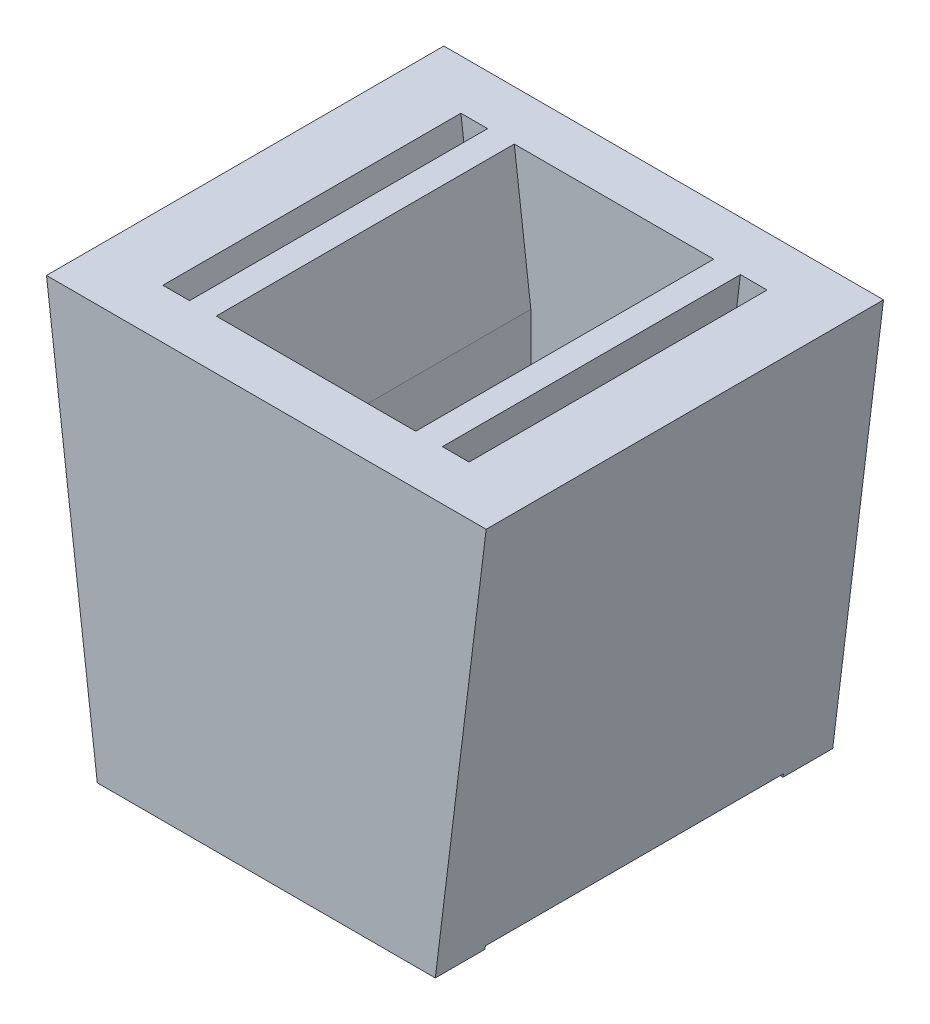
ISO-10303-21;
HEADER;
FILE_DESCRIPTION(('STEP AP214'),'2;1');
FILE_NAME('part.step','',(''),(''),'','','');
FILE_SCHEMA(('AUTOMOTIVE_DESIGN { 1 0 10303 214 1 1 1 1 }'));
ENDSEC;
DATA;
#1=APPLICATION_CONTEXT('core data for automotive mechanical design processes');
#2=APPLICATION_PROTOCOL_DEFINITION('international standard','automotive_design',2000,#1);
#3=PRODUCT_CONTEXT('',#1,'mechanical');
#4=PRODUCT('Part','Part','',(#3));
#5=PRODUCT_RELATED_PRODUCT_CATEGORY('part','',(#4));
#6=PRODUCT_DEFINITION_FORMATION('','',#4);
#7=PRODUCT_DEFINITION_CONTEXT('part definition',#1,'design');
#8=PRODUCT_DEFINITION('design','',#6,#7);
#9=PRODUCT_DEFINITION_SHAPE('','',#8);
#10=(LENGTH_UNIT() NAMED_UNIT(*) SI_UNIT(.MILLI.,.METRE.));
#11=(NAMED_UNIT(*) PLANE_ANGLE_UNIT() SI_UNIT($,.RADIAN.));
#12=(NAMED_UNIT(*) SI_UNIT($,.STERADIAN.) SOLID_ANGLE_UNIT());
#13=UNCERTAINTY_MEASURE_WITH_UNIT(LENGTH_MEASURE(1.E-05),#10,'distance_accuracy_value','');
#14=(GEOMETRIC_REPRESENTATION_CONTEXT(3) GLOBAL_UNCERTAINTY_ASSIGNED_CONTEXT((#13)) GLOBAL_UNIT_ASSIGNED_CONTEXT((#10,
#11,#12)) REPRESENTATION_CONTEXT('',''));
#15=CARTESIAN_POINT('',(0.,0.,0.));
#16=DIRECTION('',(0.,0.,1.));
#17=DIRECTION('',(1.,0.,0.));
#18=AXIS2_PLACEMENT_3D('',#15,#16,#17);
#19=CARTESIAN_POINT('',(11.5593128963236,31.0170672387913,30.));
#20=DIRECTION('',(0.992546151641322,-0.121869343405149,0.));
#21=DIRECTION('',(0.121869343405149,0.992546151641322,0.));
#22=AXIS2_PLACEMENT_3D('',#19,#20,#21);
#23=PLANE('',#22);
#24=DIRECTION('',(0.121869343405149,0.992546151641322,0.));
#25=VECTOR('',#24,1.);
#26=CARTESIAN_POINT('',(11.5593128963236,31.0170672387913,3.75));
#27=LINE('',#26,#25);
#28=CARTESIAN_POINT('',(7.72140140885321,-0.240213475105936,3.75));
#29=VERTEX_POINT('',#28);
#30=CARTESIAN_POINT('',(11.5593128963236,31.0170672387913,3.75));
#31=VERTEX_POINT('',#30);
#32=EDGE_CURVE('E228',#29,#31,#27,.T.);
#33=ORIENTED_EDGE('',*,*,#32,.F.);
#34=DIRECTION('',(0.,0.,-1.));
#35=VECTOR('',#34,1.);
#36=CARTESIAN_POINT('',(7.72140140884883,-0.24021347510604,30.));
#37=LINE('',#36,#35);
#38=CARTESIAN_POINT('',(7.72140140884883,-0.24021347510604,26.25));
#39=VERTEX_POINT('',#38);
#40=EDGE_CURVE('E323',#39,#29,#37,.T.);
#41=ORIENTED_EDGE('',*,*,#40,.F.);
#42=DIRECTION('',(-0.121869343405149,-0.992546151641322,0.));
#43=VECTOR('',#42,1.);
#44=CARTESIAN_POINT('',(11.5593128963236,31.0170672387913,26.25));
#45=LINE('',#44,#43);
#46=CARTESIAN_POINT('',(11.5593128963236,31.0170672387913,26.25));
#47=VERTEX_POINT('',#46);
#48=EDGE_CURVE('E304',#47,#39,#45,.T.);
#49=ORIENTED_EDGE('',*,*,#48,.F.);
#50=DIRECTION('',(0.,0.,-1.));
#51=VECTOR('',#50,1.);
#52=CARTESIAN_POINT('',(11.5593128963236,31.0170672387913,30.));
#53=LINE('',#52,#51);
#54=EDGE_CURVE('E312',#47,#31,#53,.T.);
#55=ORIENTED_EDGE('',*,*,#54,.T.);
#56=EDGE_LOOP('',(#33,#41,#49,#55));
#57=FACE_BOUND('',#56,.T.);
#58=ADVANCED_FACE('F33',(#57),#23,.F.);
#59=CARTESIAN_POINT('',(7.72140140884883,-0.24021347510604,30.));
#60=DIRECTION('',(-0.0473538448794738,0.998878177444643,0.));
#61=DIRECTION('',(-0.998878177444643,-0.0473538448794738,0.));
#62=AXIS2_PLACEMENT_3D('',#59,#60,#61);
#63=PLANE('',#62);
#64=DIRECTION('',(-0.998878177444643,-0.0473538448794738,0.));
#65=VECTOR('',#64,1.);
#66=CARTESIAN_POINT('',(7.72140140884883,-0.24021347510604,3.75));
#67=LINE('',#66,#65);
#68=CARTESIAN_POINT('',(12.7884450422069,0.,3.75));
#69=VERTEX_POINT('',#68);
#70=EDGE_CURVE('E226',#69,#29,#67,.T.);
#71=ORIENTED_EDGE('',*,*,#70,.F.);
#72=DIRECTION('',(0.,0.,-1.));
#73=VECTOR('',#72,1.);
#74=CARTESIAN_POINT('',(12.7884450422069,0.,30.));
#75=LINE('',#74,#73);
#76=CARTESIAN_POINT('',(12.7884450422069,0.,26.25));
#77=VERTEX_POINT('',#76);
#78=EDGE_CURVE('E320',#77,#69,#75,.T.);
#79=ORIENTED_EDGE('',*,*,#78,.F.);
#80=DIRECTION('',(0.998878177444643,0.0473538448794738,0.));
#81=VECTOR('',#80,1.);
#82=CARTESIAN_POINT('',(7.72140140884883,-0.24021347510604,26.25));
#83=LINE('',#82,#81);
#84=EDGE_CURVE('E291',#39,#77,#83,.T.);
#85=ORIENTED_EDGE('',*,*,#84,.F.);
#86=ORIENTED_EDGE('',*,*,#40,.T.);
#87=EDGE_LOOP('',(#71,#79,#85,#86));
#88=FACE_BOUND('',#87,.T.);
#89=ADVANCED_FACE('F364',(#88),#63,.F.);
#90=CARTESIAN_POINT('',(-6.27925335121256,20.8364693355736,30.));
#91=DIRECTION('',(-1.,0.,0.));
#92=DIRECTION('',(0.,-1.,0.));
#93=AXIS2_PLACEMENT_3D('',#90,#91,#92);
#94=PLANE('',#93);
#95=DIRECTION('',(0.,-1.,0.));
#96=VECTOR('',#95,1.);
#97=CARTESIAN_POINT('',(-6.27925335121256,20.8364693355736,3.75));
#98=LINE('',#97,#96);
#99=CARTESIAN_POINT('',(-6.27925335121256,20.8364693355736,3.75));
#100=VERTEX_POINT('',#99);
#101=CARTESIAN_POINT('',(-6.27925335121256,4.42545123932357,3.75));
#102=VERTEX_POINT('',#101);
#103=EDGE_CURVE('E47',#100,#102,#98,.T.);
#104=ORIENTED_EDGE('',*,*,#103,.F.);
#105=DIRECTION('',(0.,0.,-1.));
#106=VECTOR('',#105,1.);
#107=CARTESIAN_POINT('',(-6.27925335121256,20.8364693355736,30.));
#108=LINE('',#107,#106);
#109=CARTESIAN_POINT('',(-6.27925335121256,20.8364693355736,26.25));
#110=VERTEX_POINT('',#109);
#111=EDGE_CURVE('E271',#110,#100,#108,.T.);
#112=ORIENTED_EDGE('',*,*,#111,.F.);
#113=DIRECTION('',(0.,-1.,0.));
#114=VECTOR('',#113,1.);
#115=CARTESIAN_POINT('',(-6.27925335121256,31.0170672387913,26.25));
#116=LINE('',#115,#114);
#117=CARTESIAN_POINT('',(-6.27925335121256,4.42545123932357,26.25));
#118=VERTEX_POINT('',#117);
#119=EDGE_CURVE('E329',#110,#118,#116,.T.);
#120=ORIENTED_EDGE('',*,*,#119,.T.);
#121=DIRECTION('',(0.,0.,-1.));
#122=VECTOR('',#121,1.);
#123=CARTESIAN_POINT('',(-6.27925335121256,4.42545123932357,30.));
#124=LINE('',#123,#122);
#125=EDGE_CURVE('E265',#118,#102,#124,.T.);
#126=ORIENTED_EDGE('',*,*,#125,.T.);
#127=EDGE_LOOP('',(#104,#112,#120,#126));
#128=FACE_BOUND('',#127,.T.);
#129=ADVANCED_FACE('F335',(#128),#94,.F.);
#130=CARTESIAN_POINT('',(-7.52927359448819,31.0170672387913,30.));
#131=DIRECTION('',(-0.992546151641322,-0.121869343405148,0.));
#132=DIRECTION('',(0.121869343405148,-0.992546151641322,0.));
#133=AXIS2_PLACEMENT_3D('',#130,#131,#132);
#134=PLANE('',#133);
#135=DIRECTION('',(0.121869343405148,-0.992546151641322,0.));
#136=VECTOR('',#135,1.);
#137=CARTESIAN_POINT('',(-7.52927359448819,31.0170672387913,3.75));
#138=LINE('',#137,#136);
#139=CARTESIAN_POINT('',(-7.52927359448819,31.0170672387913,3.75));
#140=VERTEX_POINT('',#139);
#141=EDGE_CURVE('E54',#140,#100,#138,.T.);
#142=ORIENTED_EDGE('',*,*,#141,.F.);
#143=DIRECTION('',(0.,0.,-1.));
#144=VECTOR('',#143,1.);
#145=CARTESIAN_POINT('',(-7.52927359448819,31.0170672387913,30.));
#146=LINE('',#145,#144);
#147=CARTESIAN_POINT('',(-7.5292735944882,31.0170672387913,26.25));
#148=VERTEX_POINT('',#147);
#149=EDGE_CURVE('E269',#148,#140,#146,.T.);
#150=ORIENTED_EDGE('',*,*,#149,.F.);
#151=DIRECTION('',(0.121869343405148,-0.992546151641322,0.));
#152=VECTOR('',#151,1.);
#153=CARTESIAN_POINT('',(-6.73012742111856,24.5085439562789,26.25));
#154=LINE('',#153,#152);
#155=EDGE_CURVE('E40',#148,#110,#154,.T.);
#156=ORIENTED_EDGE('',*,*,#155,.T.);
#157=ORIENTED_EDGE('',*,*,#111,.T.);
#158=EDGE_LOOP('',(#142,#150,#156,#157));
#159=FACE_BOUND('',#158,.T.);
#160=ADVANCED_FACE('F333',(#159),#134,.F.);
#161=CARTESIAN_POINT('',(-6.27925335121256,4.42545123932357,30.));
#162=DIRECTION('',(0.992546151641322,0.121869343405149,0.));
#163=DIRECTION('',(-0.121869343405149,0.992546151641322,0.));
#164=AXIS2_PLACEMENT_3D('',#161,#162,#163);
#165=PLANE('',#164);
#166=DIRECTION('',(-0.121869343405149,0.992546151641322,0.));
#167=VECTOR('',#166,1.);
#168=CARTESIAN_POINT('',(-6.27925335121256,4.42545123932357,3.75));
#169=LINE('',#168,#167);
#170=CARTESIAN_POINT('',(-9.5442932454059,31.0170672387913,3.75));
#171=VERTEX_POINT('',#170);
#172=EDGE_CURVE('E221',#102,#171,#169,.T.);
#173=ORIENTED_EDGE('',*,*,#172,.F.);
#174=ORIENTED_EDGE('',*,*,#125,.F.);
#175=DIRECTION('',(-0.121869343405149,0.992546151641322,0.));
#176=VECTOR('',#175,1.);
#177=CARTESIAN_POINT('',(-8.71521972440122,24.2648052694686,26.25));
#178=LINE('',#177,#176);
#179=CARTESIAN_POINT('',(-9.5442932454059,31.0170672387913,26.25));
#180=VERTEX_POINT('',#179);
#181=EDGE_CURVE('E326',#118,#180,#178,.T.);
#182=ORIENTED_EDGE('',*,*,#181,.T.);
#183=DIRECTION('',(0.,0.,-1.));
#184=VECTOR('',#183,1.);
#185=CARTESIAN_POINT('',(-9.5442932454059,31.0170672387913,30.));
#186=LINE('',#185,#184);
#187=EDGE_CURVE('E267',#180,#171,#186,.T.);
#188=ORIENTED_EDGE('',*,*,#187,.T.);
#189=EDGE_LOOP('',(#173,#174,#182,#188));
#190=FACE_BOUND('',#189,.T.);
#191=ADVANCED_FACE('F338',(#190),#165,.F.);
#192=CARTESIAN_POINT('',(7.52927359448819,31.0170672387913,30.));
#193=DIRECTION('',(0.992546151641322,-0.121869343405148,0.));
#194=DIRECTION('',(0.121869343405148,0.992546151641322,0.));
#195=AXIS2_PLACEMENT_3D('',#192,#193,#194);
#196=PLANE('',#195);
#197=DIRECTION('',(0.121869343405148,0.992546151641322,0.));
#198=VECTOR('',#197,1.);
#199=CARTESIAN_POINT('',(7.52927359448819,31.0170672387913,3.75));
#200=LINE('',#199,#198);
#201=CARTESIAN_POINT('',(6.27925335121256,20.8364693355736,3.75));
#202=VERTEX_POINT('',#201);
#203=CARTESIAN_POINT('',(7.52927359448819,31.0170672387913,3.75));
#204=VERTEX_POINT('',#203);
#205=EDGE_CURVE('E218',#202,#204,#200,.T.);
#206=ORIENTED_EDGE('',*,*,#205,.F.);
#207=DIRECTION('',(0.,0.,-1.));
#208=VECTOR('',#207,1.);
#209=CARTESIAN_POINT('',(6.27925335121256,20.8364693355736,30.));
#210=LINE('',#209,#208);
#211=CARTESIAN_POINT('',(6.27925335121256,20.8364693355736,26.25));
#212=VERTEX_POINT('',#211);
#213=EDGE_CURVE('E251',#212,#202,#210,.T.);
#214=ORIENTED_EDGE('',*,*,#213,.F.);
#215=DIRECTION('',(0.121869343405148,0.992546151641322,0.));
#216=VECTOR('',#215,1.);
#217=CARTESIAN_POINT('',(8.10476816406422,35.7040943808366,26.25));
#218=LINE('',#217,#216);
#219=CARTESIAN_POINT('',(7.5292735944882,31.0170672387913,26.25));
#220=VERTEX_POINT('',#219);
#221=EDGE_CURVE('E262',#212,#220,#218,.T.);
#222=ORIENTED_EDGE('',*,*,#221,.T.);
#223=DIRECTION('',(0.,0.,-1.));
#224=VECTOR('',#223,1.);
#225=CARTESIAN_POINT('',(7.52927359448819,31.0170672387913,30.));
#226=LINE('',#225,#224);
#227=EDGE_CURVE('E254',#220,#204,#226,.T.);
#228=ORIENTED_EDGE('',*,*,#227,.T.);
#229=EDGE_LOOP('',(#206,#214,#222,#228));
#230=FACE_BOUND('',#229,.T.);
#231=ADVANCED_FACE('F430',(#230),#196,.F.);
#232=CARTESIAN_POINT('',(6.27925335121256,20.8364693355736,30.));
#233=DIRECTION('',(1.,0.,0.));
#234=DIRECTION('',(0.,1.,0.));
#235=AXIS2_PLACEMENT_3D('',#232,#233,#234);
#236=PLANE('',#235);
#237=DIRECTION('',(0.,1.,0.));
#238=VECTOR('',#237,1.);
#239=CARTESIAN_POINT('',(6.27925335121256,20.8364693355736,3.75));
#240=LINE('',#239,#238);
#241=CARTESIAN_POINT('',(6.27925335121256,4.42545123932357,3.75));
#242=VERTEX_POINT('',#241);
#243=EDGE_CURVE('E215',#242,#202,#240,.T.);
#244=ORIENTED_EDGE('',*,*,#243,.F.);
#245=DIRECTION('',(0.,0.,-1.));
#246=VECTOR('',#245,1.);
#247=CARTESIAN_POINT('',(6.27925335121256,4.42545123932357,30.));
#248=LINE('',#247,#246);
#249=CARTESIAN_POINT('',(6.27925335121256,4.42545123932357,26.25));
#250=VERTEX_POINT('',#249);
#251=EDGE_CURVE('E248',#250,#242,#248,.T.);
#252=ORIENTED_EDGE('',*,*,#251,.F.);
#253=DIRECTION('',(0.,1.,0.));
#254=VECTOR('',#253,1.);
#255=CARTESIAN_POINT('',(6.27925335121256,31.0170672387913,26.25));
#256=LINE('',#255,#254);
#257=EDGE_CURVE('E259',#250,#212,#256,.T.);
#258=ORIENTED_EDGE('',*,*,#257,.T.);
#259=ORIENTED_EDGE('',*,*,#213,.T.);
#260=EDGE_LOOP('',(#244,#252,#258,#259));
#261=FACE_BOUND('',#260,.T.);
#262=ADVANCED_FACE('F433',(#261),#236,.F.);
#263=CARTESIAN_POINT('',(8.26434565449521,20.5927306487633,30.));
#264=DIRECTION('',(-0.992546151641322,0.121869343405149,0.));
#265=DIRECTION('',(-0.121869343405149,-0.992546151641322,0.));
#266=AXIS2_PLACEMENT_3D('',#263,#264,#265);
#267=PLANE('',#266);
#268=DIRECTION('',(-0.121869343405149,-0.992546151641322,0.));
#269=VECTOR('',#268,1.);
#270=CARTESIAN_POINT('',(8.26434565449521,20.5927306487633,3.75));
#271=LINE('',#270,#269);
#272=CARTESIAN_POINT('',(9.5442932454059,31.0170672387913,3.75));
#273=VERTEX_POINT('',#272);
#274=EDGE_CURVE('E212',#273,#242,#271,.T.);
#275=ORIENTED_EDGE('',*,*,#274,.F.);
#276=DIRECTION('',(0.,0.,-1.));
#277=VECTOR('',#276,1.);
#278=CARTESIAN_POINT('',(9.5442932454059,31.0170672387913,30.));
#279=LINE('',#278,#277);
#280=CARTESIAN_POINT('',(9.5442932454059,31.0170672387913,26.25));
#281=VERTEX_POINT('',#280);
#282=EDGE_CURVE('E245',#281,#273,#279,.T.);
#283=ORIENTED_EDGE('',*,*,#282,.F.);
#284=DIRECTION('',(-0.121869343405149,-0.992546151641322,0.));
#285=VECTOR('',#284,1.);
#286=CARTESIAN_POINT('',(10.0898604673469,35.4603556940263,26.25));
#287=LINE('',#286,#285);
#288=EDGE_CURVE('E256',#281,#250,#287,.T.);
#289=ORIENTED_EDGE('',*,*,#288,.T.);
#290=ORIENTED_EDGE('',*,*,#251,.T.);
#291=EDGE_LOOP('',(#275,#283,#289,#290));
#292=FACE_BOUND('',#291,.T.);
#293=ADVANCED_FACE('F437',(#292),#267,.F.);
#294=CARTESIAN_POINT('',(-11.5593128963236,31.0170672387913,30.));
#295=DIRECTION('',(-0.992546151641322,-0.121869343405149,0.));
#296=DIRECTION('',(0.121869343405149,-0.992546151641322,0.));
#297=AXIS2_PLACEMENT_3D('',#294,#295,#296);
#298=PLANE('',#297);
#299=DIRECTION('',(0.121869343405149,-0.992546151641322,0.));
#300=VECTOR('',#299,1.);
#301=CARTESIAN_POINT('',(-11.5593128963236,31.0170672387913,3.75));
#302=LINE('',#301,#300);
#303=CARTESIAN_POINT('',(-11.5593128963236,31.0170672387913,3.75));
#304=VERTEX_POINT('',#303);
#305=CARTESIAN_POINT('',(-7.72140140884883,-0.24021347510604,3.75));
#306=VERTEX_POINT('',#305);
#307=EDGE_CURVE('E200',#304,#306,#302,.T.);
#308=ORIENTED_EDGE('',*,*,#307,.F.);
#309=DIRECTION('',(0.,0.,-1.));
#310=VECTOR('',#309,1.);
#311=CARTESIAN_POINT('',(-11.5593128963236,31.0170672387913,30.));
#312=LINE('',#311,#310);
#313=CARTESIAN_POINT('',(-11.5593128963236,31.0170672387913,26.25));
#314=VERTEX_POINT('',#313);
#315=EDGE_CURVE('E231',#314,#304,#312,.T.);
#316=ORIENTED_EDGE('',*,*,#315,.F.);
#317=DIRECTION('',(0.121869343405149,-0.992546151641322,0.));
#318=VECTOR('',#317,1.);
#319=CARTESIAN_POINT('',(-10.7003120276839,24.0210665826583,26.25));
#320=LINE('',#319,#318);
#321=CARTESIAN_POINT('',(-7.72140140884883,-0.24021347510604,26.25));
#322=VERTEX_POINT('',#321);
#323=EDGE_CURVE('E242',#314,#322,#320,.T.);
#324=ORIENTED_EDGE('',*,*,#323,.T.);
#325=DIRECTION('',(0.,0.,-1.));
#326=VECTOR('',#325,1.);
#327=CARTESIAN_POINT('',(-7.72140140884883,-0.24021347510604,30.));
#328=LINE('',#327,#326);
#329=EDGE_CURVE('E234',#322,#306,#328,.T.);
#330=ORIENTED_EDGE('',*,*,#329,.T.);
#331=EDGE_LOOP('',(#308,#316,#324,#330));
#332=FACE_BOUND('',#331,.T.);
#333=ADVANCED_FACE('F349',(#332),#298,.F.);
#334=CARTESIAN_POINT('',(-7.72140140884883,-0.24021347510604,30.));
#335=DIRECTION('',(0.0473538448794738,0.998878177444643,0.));
#336=DIRECTION('',(-0.998878177444643,0.0473538448794738,0.));
#337=AXIS2_PLACEMENT_3D('',#334,#335,#336);
#338=PLANE('',#337);
#339=DIRECTION('',(-0.998878177444643,0.0473538448794738,0.));
#340=VECTOR('',#339,1.);
#341=CARTESIAN_POINT('',(-7.72140140884883,-0.24021347510604,3.75));
#342=LINE('',#341,#340);
#343=CARTESIAN_POINT('',(-12.7884450422069,0.,3.75));
#344=VERTEX_POINT('',#343);
#345=EDGE_CURVE('E11',#306,#344,#342,.T.);
#346=ORIENTED_EDGE('',*,*,#345,.F.);
#347=ORIENTED_EDGE('',*,*,#329,.F.);
#348=DIRECTION('',(-0.998878177444643,0.0473538448794738,0.));
#349=VECTOR('',#348,1.);
#350=CARTESIAN_POINT('',(44.6779624662438,-2.7243115410704,26.25));
#351=LINE('',#350,#349);
#352=CARTESIAN_POINT('',(-12.7884450422069,0.,26.25));
#353=VERTEX_POINT('',#352);
#354=EDGE_CURVE('E239',#322,#353,#351,.T.);
#355=ORIENTED_EDGE('',*,*,#354,.T.);
#356=DIRECTION('',(0.,0.,-1.));
#357=VECTOR('',#356,1.);
#358=CARTESIAN_POINT('',(-12.7884450422069,0.,30.));
#359=LINE('',#358,#357);
#360=EDGE_CURVE('E237',#353,#344,#359,.T.);
#361=ORIENTED_EDGE('',*,*,#360,.T.);
#362=EDGE_LOOP('',(#346,#347,#355,#361));
#363=FACE_BOUND('',#362,.T.);
#364=ADVANCED_FACE('F423',(#363),#338,.F.);
#365=CARTESIAN_POINT('',(46.2775409262004,31.0170672387913,26.25));
#366=DIRECTION('',(0.,0.,1.));
#367=DIRECTION('',(0.,-1.,0.));
#368=AXIS2_PLACEMENT_3D('',#365,#366,#367);
#369=PLANE('',#368);
#370=ORIENTED_EDGE('',*,*,#354,.F.);
#371=DIRECTION('',(-1.,0.,0.));
#372=VECTOR('',#371,1.);
#373=CARTESIAN_POINT('',(46.2775409262004,-0.24021347510604,26.25));
#374=LINE('',#373,#372);
#375=CARTESIAN_POINT('',(-12.7589505361431,-0.24021347510604,26.25));
#376=VERTEX_POINT('',#375);
#377=EDGE_CURVE('E295',#322,#376,#374,.T.);
#378=ORIENTED_EDGE('',*,*,#377,.T.);
#379=DIRECTION('',(0.121869343405149,-0.992546151641322,0.));
#380=VECTOR('',#379,1.);
#381=CARTESIAN_POINT('',(-17.0376835288361,34.6072702901903,26.25));
#382=LINE('',#381,#380);
#383=EDGE_CURVE('E273',#353,#376,#382,.T.);
#384=ORIENTED_EDGE('',*,*,#383,.F.);
#385=EDGE_LOOP('',(#370,#378,#384));
#386=FACE_BOUND('',#385,.T.);
#387=ADVANCED_FACE('F377',(#386),#369,.F.);
#388=ORIENTED_EDGE('',*,*,#323,.F.);
#389=DIRECTION('',(-1.,0.,0.));
#390=VECTOR('',#389,1.);
#391=CARTESIAN_POINT('',(46.2775409262004,31.0170672387913,26.25));
#392=LINE('',#391,#390);
#393=EDGE_CURVE('E284',#180,#314,#392,.T.);
#394=ORIENTED_EDGE('',*,*,#393,.F.);
#395=ORIENTED_EDGE('',*,*,#181,.F.);
#396=ORIENTED_EDGE('',*,*,#119,.F.);
#397=ORIENTED_EDGE('',*,*,#155,.F.);
#398=EDGE_CURVE('E296',#220,#148,#392,.T.);
#399=ORIENTED_EDGE('',*,*,#398,.F.);
#400=ORIENTED_EDGE('',*,*,#221,.F.);
#401=ORIENTED_EDGE('',*,*,#257,.F.);
#402=ORIENTED_EDGE('',*,*,#288,.F.);
#403=EDGE_CURVE('E292',#47,#281,#392,.T.);
#404=ORIENTED_EDGE('',*,*,#403,.F.);
#405=ORIENTED_EDGE('',*,*,#48,.T.);
#406=EDGE_CURVE('E300',#39,#322,#374,.T.);
#407=ORIENTED_EDGE('',*,*,#406,.T.);
#408=EDGE_LOOP('',(#388,#394,#395,#396,#397,#399,#400,#401,#402,#404,#405,#407));
#409=FACE_BOUND('',#408,.T.);
#410=ADVANCED_FACE('F412',(#409),#369,.F.);
#411=CARTESIAN_POINT('',(16.5968620236178,31.0170672387913,30.));
#412=DIRECTION('',(-0.992546151641322,0.121869343405149,0.));
#413=DIRECTION('',(-0.121869343405149,-0.992546151641322,0.));
#414=AXIS2_PLACEMENT_3D('',#411,#412,#413);
#415=PLANE('',#414);
#416=DIRECTION('',(0.121869343405149,0.992546151641322,0.));
#417=VECTOR('',#416,1.);
#418=CARTESIAN_POINT('',(16.5968620236178,31.0170672387913,0.));
#419=LINE('',#418,#417);
#420=CARTESIAN_POINT('',(12.7589505361431,-0.24021347510604,0.));
#421=VERTEX_POINT('',#420);
#422=CARTESIAN_POINT('',(16.5968620236178,31.0170672387913,0.));
#423=VERTEX_POINT('',#422);
#424=EDGE_CURVE('E306',#421,#423,#419,.T.);
#425=ORIENTED_EDGE('',*,*,#424,.T.);
#426=DIRECTION('',(0.,0.,-1.));
#427=VECTOR('',#426,1.);
#428=CARTESIAN_POINT('',(16.5968620236178,31.0170672387913,30.));
#429=LINE('',#428,#427);
#430=CARTESIAN_POINT('',(16.5968620236178,31.0170672387913,30.));
#431=VERTEX_POINT('',#430);
#432=EDGE_CURVE('E318',#431,#423,#429,.T.);
#433=ORIENTED_EDGE('',*,*,#432,.F.);
#434=DIRECTION('',(0.121869343405149,0.992546151641322,0.));
#435=VECTOR('',#434,1.);
#436=CARTESIAN_POINT('',(16.5968620236178,31.0170672387913,30.));
#437=LINE('',#436,#435);
#438=CARTESIAN_POINT('',(12.7589505361431,-0.24021347510604,30.));
#439=VERTEX_POINT('',#438);
#440=EDGE_CURVE('E307',#439,#431,#437,.T.);
#441=ORIENTED_EDGE('',*,*,#440,.F.);
#442=DIRECTION('',(0.,0.,1.));
#443=VECTOR('',#442,1.);
#444=CARTESIAN_POINT('',(12.7589505361431,-0.24021347510604,30.));
#445=LINE('',#444,#443);
#446=CARTESIAN_POINT('',(12.7589505361431,-0.240213475106048,26.25));
#447=VERTEX_POINT('',#446);
#448=EDGE_CURVE('E287',#447,#439,#445,.T.);
#449=ORIENTED_EDGE('',*,*,#448,.F.);
#450=DIRECTION('',(-0.121869343405149,-0.992546151641322,0.));
#451=VECTOR('',#450,1.);
#452=CARTESIAN_POINT('',(17.0376835288361,34.6072702901903,26.25));
#453=LINE('',#452,#451);
#454=EDGE_CURVE('E285',#77,#447,#453,.T.);
#455=ORIENTED_EDGE('',*,*,#454,.F.);
#456=ORIENTED_EDGE('',*,*,#78,.T.);
#457=DIRECTION('',(0.121869343405149,0.992546151641322,0.));
#458=VECTOR('',#457,1.);
#459=CARTESIAN_POINT('',(17.0376835288361,34.6072702901903,3.75));
#460=LINE('',#459,#458);
#461=CARTESIAN_POINT('',(12.7589505361431,-0.24021347510604,3.75));
#462=VERTEX_POINT('',#461);
#463=EDGE_CURVE('E198',#462,#69,#460,.T.);
#464=ORIENTED_EDGE('',*,*,#463,.F.);
#465=DIRECTION('',(0.,0.,1.));
#466=VECTOR('',#465,1.);
#467=CARTESIAN_POINT('',(12.7589505361431,-0.24021347510604,0.));
#468=LINE('',#467,#466);
#469=EDGE_CURVE('E201',#421,#462,#468,.T.);
#470=ORIENTED_EDGE('',*,*,#469,.F.);
#471=EDGE_LOOP('',(#425,#433,#441,#449,#455,#456,#464,#470));
#472=FACE_BOUND('',#471,.T.);
#473=ADVANCED_FACE('F391',(#472),#415,.F.);
#474=CARTESIAN_POINT('',(11.5593128963236,31.0170672387913,30.));
#475=DIRECTION('',(0.,-1.,0.));
#476=DIRECTION('',(1.,0.,0.));
#477=AXIS2_PLACEMENT_3D('',#474,#475,#476);
#478=PLANE('',#477);
#479=DIRECTION('',(-1.,0.,0.));
#480=VECTOR('',#479,1.);
#481=CARTESIAN_POINT('',(11.5593128963236,31.0170672387913,0.));
#482=LINE('',#481,#480);
#483=CARTESIAN_POINT('',(-16.5968620236178,31.0170672387913,0.));
#484=VERTEX_POINT('',#483);
#485=EDGE_CURVE('E310',#423,#484,#482,.T.);
#486=ORIENTED_EDGE('',*,*,#485,.T.);
#487=DIRECTION('',(0.,0.,-1.));
#488=VECTOR('',#487,1.);
#489=CARTESIAN_POINT('',(-16.5968620236178,31.0170672387913,30.));
#490=LINE('',#489,#488);
#491=CARTESIAN_POINT('',(-16.5968620236178,31.0170672387913,30.));
#492=VERTEX_POINT('',#491);
#493=EDGE_CURVE('E276',#492,#484,#490,.T.);
#494=ORIENTED_EDGE('',*,*,#493,.F.);
#495=DIRECTION('',(-1.,0.,0.));
#496=VECTOR('',#495,1.);
#497=CARTESIAN_POINT('',(11.5593128963236,31.0170672387913,30.));
#498=LINE('',#497,#496);
#499=EDGE_CURVE('E309',#431,#492,#498,.T.);
#500=ORIENTED_EDGE('',*,*,#499,.F.);
#501=ORIENTED_EDGE('',*,*,#432,.T.);
#502=EDGE_LOOP('',(#486,#494,#500,#501));
#503=FACE_BOUND('',#502,.T.);
#504=ORIENTED_EDGE('',*,*,#315,.T.);
#505=DIRECTION('',(-1.,0.,0.));
#506=VECTOR('',#505,1.);
#507=CARTESIAN_POINT('',(46.2775409262004,31.0170672387913,3.75));
#508=LINE('',#507,#506);
#509=EDGE_CURVE('E203',#171,#304,#508,.T.);
#510=ORIENTED_EDGE('',*,*,#509,.F.);
#511=ORIENTED_EDGE('',*,*,#187,.F.);
#512=ORIENTED_EDGE('',*,*,#393,.T.);
#513=EDGE_LOOP('',(#504,#510,#511,#512));
#514=FACE_BOUND('',#513,.T.);
#515=ORIENTED_EDGE('',*,*,#149,.T.);
#516=EDGE_CURVE('E206',#204,#140,#508,.T.);
#517=ORIENTED_EDGE('',*,*,#516,.F.);
#518=ORIENTED_EDGE('',*,*,#227,.F.);
#519=ORIENTED_EDGE('',*,*,#398,.T.);
#520=EDGE_LOOP('',(#515,#517,#518,#519));
#521=FACE_BOUND('',#520,.T.);
#522=EDGE_CURVE('E207',#31,#273,#508,.T.);
#523=ORIENTED_EDGE('',*,*,#522,.F.);
#524=ORIENTED_EDGE('',*,*,#54,.F.);
#525=ORIENTED_EDGE('',*,*,#403,.T.);
#526=ORIENTED_EDGE('',*,*,#282,.T.);
#527=EDGE_LOOP('',(#523,#524,#525,#526));
#528=FACE_BOUND('',#527,.T.);
#529=ADVANCED_FACE('F344',(#503,#514,#521,#528),#478,.F.);
#530=CARTESIAN_POINT('',(0.,0.,30.));
#531=DIRECTION('',(0.,0.,1.));
#532=DIRECTION('',(1.,0.,0.));
#533=AXIS2_PLACEMENT_3D('',#530,#531,#532);
#534=PLANE('',#533);
#535=ORIENTED_EDGE('',*,*,#499,.T.);
#536=DIRECTION('',(-0.121869343405149,0.992546151641322,0.));
#537=VECTOR('',#536,1.);
#538=CARTESIAN_POINT('',(-17.0376835288361,34.6072702901903,30.));
#539=LINE('',#538,#537);
#540=CARTESIAN_POINT('',(-12.7589505361431,-0.24021347510604,30.));
#541=VERTEX_POINT('',#540);
#542=EDGE_CURVE('E278',#541,#492,#539,.T.);
#543=ORIENTED_EDGE('',*,*,#542,.F.);
#544=DIRECTION('',(-1.,0.,0.));
#545=VECTOR('',#544,1.);
#546=CARTESIAN_POINT('',(46.2775409262004,-0.24021347510604,30.));
#547=LINE('',#546,#545);
#548=EDGE_CURVE('E288',#439,#541,#547,.T.);
#549=ORIENTED_EDGE('',*,*,#548,.F.);
#550=ORIENTED_EDGE('',*,*,#440,.T.);
#551=EDGE_LOOP('',(#535,#543,#549,#550));
#552=FACE_BOUND('',#551,.T.);
#553=ADVANCED_FACE('F381',(#552),#534,.T.);
#554=CARTESIAN_POINT('',(0.,0.,0.));
#555=DIRECTION('',(0.,0.,1.));
#556=DIRECTION('',(1.,0.,0.));
#557=AXIS2_PLACEMENT_3D('',#554,#555,#556);
#558=PLANE('',#557);
#559=ORIENTED_EDGE('',*,*,#424,.F.);
#560=DIRECTION('',(-1.,0.,0.));
#561=VECTOR('',#560,1.);
#562=CARTESIAN_POINT('',(46.2775409262004,-0.24021347510604,0.));
#563=LINE('',#562,#561);
#564=CARTESIAN_POINT('',(-12.7589505361431,-0.24021347510604,0.));
#565=VERTEX_POINT('',#564);
#566=EDGE_CURVE('E182',#421,#565,#563,.T.);
#567=ORIENTED_EDGE('',*,*,#566,.T.);
#568=DIRECTION('',(0.121869343405149,-0.992546151641322,0.));
#569=VECTOR('',#568,1.);
#570=CARTESIAN_POINT('',(-16.5968620236178,31.0170672387913,0.));
#571=LINE('',#570,#569);
#572=EDGE_CURVE('E193',#484,#565,#571,.T.);
#573=ORIENTED_EDGE('',*,*,#572,.F.);
#574=ORIENTED_EDGE('',*,*,#485,.F.);
#575=EDGE_LOOP('',(#559,#567,#573,#574));
#576=FACE_BOUND('',#575,.T.);
#577=ADVANCED_FACE('F389',(#576),#558,.F.);
#578=EDGE_CURVE('E297',#447,#39,#374,.T.);
#579=ORIENTED_EDGE('',*,*,#578,.T.);
#580=ORIENTED_EDGE('',*,*,#84,.T.);
#581=ORIENTED_EDGE('',*,*,#454,.T.);
#582=EDGE_LOOP('',(#579,#580,#581));
#583=FACE_BOUND('',#582,.T.);
#584=ADVANCED_FACE('F367',(#583),#369,.F.);
#585=CARTESIAN_POINT('',(46.2775409262004,-0.24021347510604,30.));
#586=DIRECTION('',(0.,1.,0.));
#587=DIRECTION('',(0.,0.,1.));
#588=AXIS2_PLACEMENT_3D('',#585,#586,#587);
#589=PLANE('',#588);
#590=ORIENTED_EDGE('',*,*,#377,.F.);
#591=ORIENTED_EDGE('',*,*,#406,.F.);
#592=ORIENTED_EDGE('',*,*,#578,.F.);
#593=ORIENTED_EDGE('',*,*,#448,.T.);
#594=ORIENTED_EDGE('',*,*,#548,.T.);
#595=DIRECTION('',(0.,0.,1.));
#596=VECTOR('',#595,1.);
#597=CARTESIAN_POINT('',(-12.7589505361431,-0.24021347510604,30.));
#598=LINE('',#597,#596);
#599=EDGE_CURVE('E281',#376,#541,#598,.T.);
#600=ORIENTED_EDGE('',*,*,#599,.F.);
#601=EDGE_LOOP('',(#590,#591,#592,#593,#594,#600));
#602=FACE_BOUND('',#601,.T.);
#603=ADVANCED_FACE('F373',(#602),#589,.F.);
#604=CARTESIAN_POINT('',(-16.5968620236178,31.0170672387913,30.));
#605=DIRECTION('',(0.992546151641322,0.121869343405149,0.));
#606=DIRECTION('',(-0.121869343405149,0.992546151641322,0.));
#607=AXIS2_PLACEMENT_3D('',#604,#605,#606);
#608=PLANE('',#607);
#609=ORIENTED_EDGE('',*,*,#572,.T.);
#610=DIRECTION('',(0.,0.,1.));
#611=VECTOR('',#610,1.);
#612=CARTESIAN_POINT('',(-12.7589505361431,-0.24021347510604,0.));
#613=LINE('',#612,#611);
#614=CARTESIAN_POINT('',(-12.7589505361431,-0.240213475106048,3.75));
#615=VERTEX_POINT('',#614);
#616=EDGE_CURVE('E177',#565,#615,#613,.T.);
#617=ORIENTED_EDGE('',*,*,#616,.T.);
#618=DIRECTION('',(-0.121869343405149,0.992546151641322,0.));
#619=VECTOR('',#618,1.);
#620=CARTESIAN_POINT('',(-17.0376835288361,34.6072702901903,3.75));
#621=LINE('',#620,#619);
#622=EDGE_CURVE('E190',#615,#344,#621,.T.);
#623=ORIENTED_EDGE('',*,*,#622,.T.);
#624=ORIENTED_EDGE('',*,*,#360,.F.);
#625=ORIENTED_EDGE('',*,*,#383,.T.);
#626=ORIENTED_EDGE('',*,*,#599,.T.);
#627=ORIENTED_EDGE('',*,*,#542,.T.);
#628=ORIENTED_EDGE('',*,*,#493,.T.);
#629=EDGE_LOOP('',(#609,#617,#623,#624,#625,#626,#627,#628));
#630=FACE_BOUND('',#629,.T.);
#631=ADVANCED_FACE('F188',(#630),#608,.F.);
#632=CARTESIAN_POINT('',(46.2775409262004,31.0170672387913,3.75));
#633=DIRECTION('',(0.,0.,-1.));
#634=DIRECTION('',(0.,1.,0.));
#635=AXIS2_PLACEMENT_3D('',#632,#633,#634);
#636=PLANE('',#635);
#637=DIRECTION('',(-1.,0.,0.));
#638=VECTOR('',#637,1.);
#639=CARTESIAN_POINT('',(46.2775409262004,-0.24021347510604,3.75));
#640=LINE('',#639,#638);
#641=EDGE_CURVE('E179',#29,#306,#640,.T.);
#642=ORIENTED_EDGE('',*,*,#641,.F.);
#643=ORIENTED_EDGE('',*,*,#32,.T.);
#644=ORIENTED_EDGE('',*,*,#522,.T.);
#645=ORIENTED_EDGE('',*,*,#274,.T.);
#646=ORIENTED_EDGE('',*,*,#243,.T.);
#647=ORIENTED_EDGE('',*,*,#205,.T.);
#648=ORIENTED_EDGE('',*,*,#516,.T.);
#649=ORIENTED_EDGE('',*,*,#141,.T.);
#650=ORIENTED_EDGE('',*,*,#103,.T.);
#651=ORIENTED_EDGE('',*,*,#172,.T.);
#652=ORIENTED_EDGE('',*,*,#509,.T.);
#653=ORIENTED_EDGE('',*,*,#307,.T.);
#654=EDGE_LOOP('',(#642,#643,#644,#645,#646,#647,#648,#649,#650,#651,#652,#653));
#655=FACE_BOUND('',#654,.T.);
#656=ADVANCED_FACE('F342',(#655),#636,.F.);
#657=ORIENTED_EDGE('',*,*,#463,.T.);
#658=ORIENTED_EDGE('',*,*,#70,.T.);
#659=EDGE_CURVE('E184',#462,#29,#640,.T.);
#660=ORIENTED_EDGE('',*,*,#659,.F.);
#661=EDGE_LOOP('',(#657,#658,#660));
#662=FACE_BOUND('',#661,.T.);
#663=ADVANCED_FACE('F392',(#662),#636,.F.);
#664=EDGE_CURVE('E173',#306,#615,#640,.T.);
#665=ORIENTED_EDGE('',*,*,#664,.F.);
#666=ORIENTED_EDGE('',*,*,#345,.T.);
#667=ORIENTED_EDGE('',*,*,#622,.F.);
#668=EDGE_LOOP('',(#665,#666,#667));
#669=FACE_BOUND('',#668,.T.);
#670=ADVANCED_FACE('F195',(#669),#636,.F.);
#671=CARTESIAN_POINT('',(46.2775409262004,-0.24021347510604,0.));
#672=DIRECTION('',(0.,1.,0.));
#673=DIRECTION('',(0.,0.,1.));
#674=AXIS2_PLACEMENT_3D('',#671,#672,#673);
#675=PLANE('',#674);
#676=ORIENTED_EDGE('',*,*,#659,.T.);
#677=ORIENTED_EDGE('',*,*,#641,.T.);
#678=ORIENTED_EDGE('',*,*,#664,.T.);
#679=ORIENTED_EDGE('',*,*,#616,.F.);
#680=ORIENTED_EDGE('',*,*,#566,.F.);
#681=ORIENTED_EDGE('',*,*,#469,.T.);
#682=EDGE_LOOP('',(#676,#677,#678,#679,#680,#681));
#683=FACE_BOUND('',#682,.T.);
#684=ADVANCED_FACE('F176',(#683),#675,.F.);
#685=CLOSED_SHELL('',(#58,#89,#129,#160,#191,#231,#262,#293,#333,#364,#387,#410,#473,#529,#553,
#577,#584,#603,#631,#656,#663,#670,#684));
#686=MANIFOLD_SOLID_BREP('B2',#685);
#687=ADVANCED_BREP_SHAPE_REPRESENTATION('',(#18,#686),#14);
#688=SHAPE_DEFINITION_REPRESENTATION(#9,#687);
ENDSEC;
END-ISO-10303-21;
